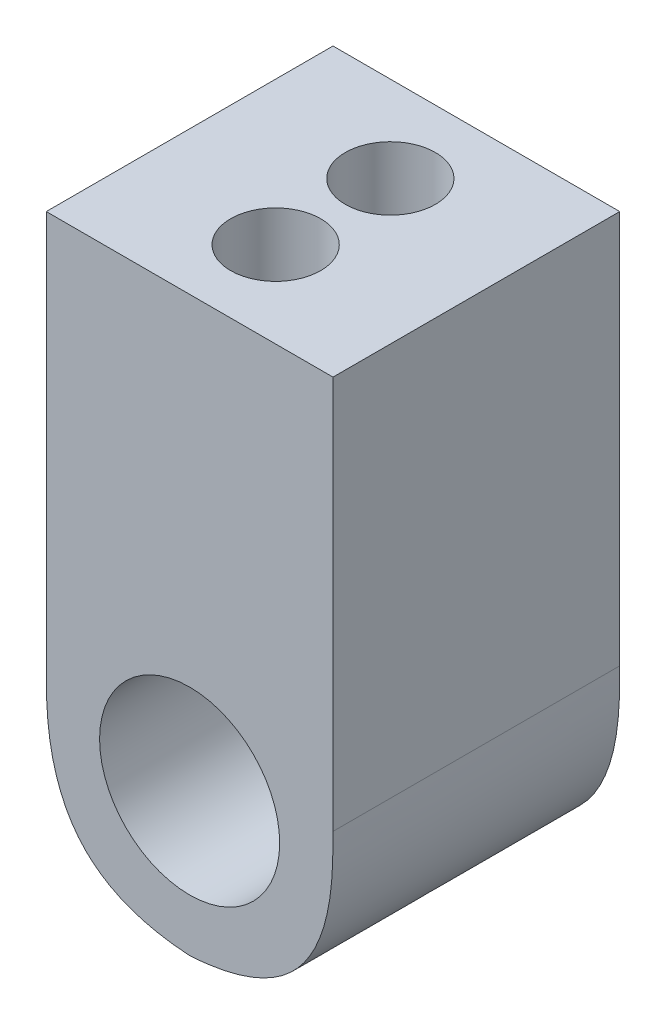
ISO-10303-21;
HEADER;
FILE_DESCRIPTION(('STEP AP214'),'2;1');
FILE_NAME('part.step','',(''),(''),'','','');
FILE_SCHEMA(('AUTOMOTIVE_DESIGN { 1 0 10303 214 1 1 1 1 }'));
ENDSEC;
DATA;
#1=APPLICATION_CONTEXT('core data for automotive mechanical design processes');
#2=APPLICATION_PROTOCOL_DEFINITION('international standard','automotive_design',2000,#1);
#3=PRODUCT_CONTEXT('',#1,'mechanical');
#4=PRODUCT('Part','Part','',(#3));
#5=PRODUCT_RELATED_PRODUCT_CATEGORY('part','',(#4));
#6=PRODUCT_DEFINITION_FORMATION('','',#4);
#7=PRODUCT_DEFINITION_CONTEXT('part definition',#1,'design');
#8=PRODUCT_DEFINITION('design','',#6,#7);
#9=PRODUCT_DEFINITION_SHAPE('','',#8);
#10=(LENGTH_UNIT() NAMED_UNIT(*) SI_UNIT(.MILLI.,.METRE.));
#11=(NAMED_UNIT(*) PLANE_ANGLE_UNIT() SI_UNIT($,.RADIAN.));
#12=(NAMED_UNIT(*) SI_UNIT($,.STERADIAN.) SOLID_ANGLE_UNIT());
#13=UNCERTAINTY_MEASURE_WITH_UNIT(LENGTH_MEASURE(1.E-05),#10,'distance_accuracy_value','');
#14=(GEOMETRIC_REPRESENTATION_CONTEXT(3) GLOBAL_UNCERTAINTY_ASSIGNED_CONTEXT((#13)) GLOBAL_UNIT_ASSIGNED_CONTEXT((#10,
#11,#12)) REPRESENTATION_CONTEXT('',''));
#15=CARTESIAN_POINT('',(0.,0.,0.));
#16=DIRECTION('',(0.,0.,1.));
#17=DIRECTION('',(1.,0.,0.));
#18=AXIS2_PLACEMENT_3D('',#15,#16,#17);
#19=CARTESIAN_POINT('',(-6.35,0.,-12.7));
#20=DIRECTION('',(1.,0.,0.));
#21=DIRECTION('',(0.,0.,-1.));
#22=AXIS2_PLACEMENT_3D('',#19,#20,#21);
#23=PLANE('',#22);
#24=DIRECTION('',(0.,1.,0.));
#25=VECTOR('',#24,1.);
#26=CARTESIAN_POINT('',(-6.35,0.,-12.7));
#27=LINE('',#26,#25);
#28=CARTESIAN_POINT('',(-6.35,1.6256,-12.7));
#29=VERTEX_POINT('',#28);
#30=CARTESIAN_POINT('',(-6.35,19.05,-12.7));
#31=VERTEX_POINT('',#30);
#32=EDGE_CURVE('E102',#29,#31,#27,.T.);
#33=ORIENTED_EDGE('',*,*,#32,.F.);
#34=CARTESIAN_POINT('',(-6.35,1.6256,0.635));
#35=CARTESIAN_POINT('',(-6.35,1.6256,-4.02166666666667));
#36=CARTESIAN_POINT('',(-6.35,1.6256,-8.67833333332475));
#37=CARTESIAN_POINT('',(-6.35,1.6256,-13.335));
#38=B_SPLINE_CURVE_WITH_KNOTS('',3,(#34,#35,#36,#37),.UNSPECIFIED.,.F.,.F.,(4,4),(-0.013335,
0.000635),.UNSPECIFIED.);
#39=CARTESIAN_POINT('',(-6.35,1.6256,0.));
#40=VERTEX_POINT('',#39);
#41=EDGE_CURVE('E116',#29,#40,#38,.F.);
#42=ORIENTED_EDGE('',*,*,#41,.T.);
#43=DIRECTION('',(0.,1.,0.));
#44=VECTOR('',#43,1.);
#45=CARTESIAN_POINT('',(-6.35,0.,0.));
#46=LINE('',#45,#44);
#47=CARTESIAN_POINT('',(-6.35,19.05,0.));
#48=VERTEX_POINT('',#47);
#49=EDGE_CURVE('E120',#40,#48,#46,.T.);
#50=ORIENTED_EDGE('',*,*,#49,.T.);
#51=DIRECTION('',(0.,0.,1.));
#52=VECTOR('',#51,1.);
#53=CARTESIAN_POINT('',(-6.35,19.05,-12.7));
#54=LINE('',#53,#52);
#55=EDGE_CURVE('E114',#31,#48,#54,.T.);
#56=ORIENTED_EDGE('',*,*,#55,.F.);
#57=EDGE_LOOP('',(#33,#42,#50,#56));
#58=FACE_BOUND('',#57,.T.);
#59=ADVANCED_FACE('F43',(#58),#23,.F.);
#60=CARTESIAN_POINT('',(0.,19.05,-12.7));
#61=DIRECTION('',(0.,-1.,0.));
#62=DIRECTION('',(0.,0.,-1.));
#63=AXIS2_PLACEMENT_3D('',#60,#61,#62);
#64=PLANE('',#63);
#65=CARTESIAN_POINT('',(0.,19.05,-8.89));
#66=DIRECTION('',(0.,1.,0.));
#67=DIRECTION('',(0.,0.,1.));
#68=AXIS2_PLACEMENT_3D('',#65,#66,#67);
#69=CIRCLE('',#68,1.9939);
#70=CARTESIAN_POINT('',(0.,19.05,-6.8961));
#71=VERTEX_POINT('',#70);
#72=EDGE_CURVE('E179',#71,#71,#69,.T.);
#73=ORIENTED_EDGE('',*,*,#72,.F.);
#74=EDGE_LOOP('',(#73));
#75=FACE_BOUND('',#74,.T.);
#76=CARTESIAN_POINT('',(0.,19.05,-3.81));
#77=DIRECTION('',(0.,1.,0.));
#78=DIRECTION('',(0.,0.,1.));
#79=AXIS2_PLACEMENT_3D('',#76,#77,#78);
#80=CIRCLE('',#79,1.9939);
#81=CARTESIAN_POINT('',(0.,19.05,-1.8161));
#82=VERTEX_POINT('',#81);
#83=EDGE_CURVE('E172',#82,#82,#80,.T.);
#84=ORIENTED_EDGE('',*,*,#83,.F.);
#85=EDGE_LOOP('',(#84));
#86=FACE_BOUND('',#85,.T.);
#87=DIRECTION('',(1.,0.,0.));
#88=VECTOR('',#87,1.);
#89=CARTESIAN_POINT('',(0.,19.05,0.));
#90=LINE('',#89,#88);
#91=CARTESIAN_POINT('',(6.35,19.05,0.));
#92=VERTEX_POINT('',#91);
#93=EDGE_CURVE('E113',#48,#92,#90,.T.);
#94=ORIENTED_EDGE('',*,*,#93,.T.);
#95=DIRECTION('',(0.,0.,1.));
#96=VECTOR('',#95,1.);
#97=CARTESIAN_POINT('',(6.35,19.05,-12.7));
#98=LINE('',#97,#96);
#99=CARTESIAN_POINT('',(6.35,19.05,-12.7));
#100=VERTEX_POINT('',#99);
#101=EDGE_CURVE('E99',#100,#92,#98,.T.);
#102=ORIENTED_EDGE('',*,*,#101,.F.);
#103=DIRECTION('',(1.,0.,0.));
#104=VECTOR('',#103,1.);
#105=CARTESIAN_POINT('',(0.,19.05,-12.7));
#106=LINE('',#105,#104);
#107=EDGE_CURVE('E101',#31,#100,#106,.T.);
#108=ORIENTED_EDGE('',*,*,#107,.F.);
#109=ORIENTED_EDGE('',*,*,#55,.T.);
#110=EDGE_LOOP('',(#94,#102,#108,#109));
#111=FACE_BOUND('',#110,.T.);
#112=ADVANCED_FACE('F111',(#75,#86,#111),#64,.F.);
#113=CARTESIAN_POINT('',(6.35,0.,-12.7));
#114=DIRECTION('',(1.,0.,0.));
#115=DIRECTION('',(0.,0.,-1.));
#116=AXIS2_PLACEMENT_3D('',#113,#114,#115);
#117=PLANE('',#116);
#118=DIRECTION('',(0.,1.,0.));
#119=VECTOR('',#118,1.);
#120=CARTESIAN_POINT('',(6.35,0.,0.));
#121=LINE('',#120,#119);
#122=CARTESIAN_POINT('',(6.35,1.6256,0.));
#123=VERTEX_POINT('',#122);
#124=EDGE_CURVE('E123',#123,#92,#121,.T.);
#125=ORIENTED_EDGE('',*,*,#124,.F.);
#126=CARTESIAN_POINT('',(6.35,1.6256,-13.335));
#127=CARTESIAN_POINT('',(6.35,1.6256,-8.67833333332475));
#128=CARTESIAN_POINT('',(6.35,1.6256,-4.02166666666667));
#129=CARTESIAN_POINT('',(6.35,1.6256,0.634999999999998));
#130=B_SPLINE_CURVE_WITH_KNOTS('',3,(#126,#127,#128,#129),.UNSPECIFIED.,.F.,.F.,(4,4),
(-0.000635,0.013335),.UNSPECIFIED.);
#131=CARTESIAN_POINT('',(6.35,1.6256,-12.7));
#132=VERTEX_POINT('',#131);
#133=EDGE_CURVE('E11',#123,#132,#130,.F.);
#134=ORIENTED_EDGE('',*,*,#133,.T.);
#135=DIRECTION('',(0.,1.,0.));
#136=VECTOR('',#135,1.);
#137=CARTESIAN_POINT('',(6.35,0.,-12.7));
#138=LINE('',#137,#136);
#139=EDGE_CURVE('E95',#132,#100,#138,.T.);
#140=ORIENTED_EDGE('',*,*,#139,.T.);
#141=ORIENTED_EDGE('',*,*,#101,.T.);
#142=EDGE_LOOP('',(#125,#134,#140,#141));
#143=FACE_BOUND('',#142,.T.);
#144=ADVANCED_FACE('F97',(#143),#117,.T.);
#145=CARTESIAN_POINT('',(0.,0.,-12.7));
#146=DIRECTION('',(0.,0.,1.));
#147=DIRECTION('',(1.,0.,0.));
#148=AXIS2_PLACEMENT_3D('',#145,#146,#147);
#149=PLANE('',#148);
#150=CARTESIAN_POINT('',(0.,0.,-12.7));
#151=DIRECTION('',(0.,0.,1.));
#152=DIRECTION('',(1.,0.,0.));
#153=AXIS2_PLACEMENT_3D('',#150,#151,#152);
#154=CIRCLE('',#153,3.9878);
#155=CARTESIAN_POINT('',(3.9878,0.,-12.7));
#156=VERTEX_POINT('',#155);
#157=EDGE_CURVE('E176',#156,#156,#154,.T.);
#158=ORIENTED_EDGE('',*,*,#157,.T.);
#159=EDGE_LOOP('',(#158));
#160=FACE_BOUND('',#159,.T.);
#161=CARTESIAN_POINT('',(-1.6256,-6.35,-12.7));
#162=CARTESIAN_POINT('',(-0.284119620185859,-6.35,-12.7));
#163=CARTESIAN_POINT('',(1.05736075962828,-6.35,-12.7));
#164=CARTESIAN_POINT('',(4.01400084403143,-5.77821392415533,-12.7));
#165=CARTESIAN_POINT('',(5.77821392415533,-4.01400084403143,-12.7));
#166=CARTESIAN_POINT('',(6.35,-1.05736075962829,-12.7));
#167=CARTESIAN_POINT('',(6.35,0.284119620185857,-12.7));
#168=CARTESIAN_POINT('',(6.35,1.6256,-12.7));
#169=B_SPLINE_CURVE_WITH_KNOTS('',5,(#161,#162,#163,#164,#165,#166,#167,#168),.UNSPECIFIED.,.F.,
.F.,(6,2,6),(0.,0.5,1.),.UNSPECIFIED.);
#170=CARTESIAN_POINT('',(-7.25062341599403E-07,-6.3144499642676,-12.7));
#171=VERTEX_POINT('',#170);
#172=EDGE_CURVE('E64',#132,#171,#169,.F.);
#173=ORIENTED_EDGE('',*,*,#172,.T.);
#174=CARTESIAN_POINT('',(-6.35,1.6256,-12.7));
#175=CARTESIAN_POINT('',(-6.35,0.284119620185856,-12.7));
#176=CARTESIAN_POINT('',(-6.35,-1.05736075962829,-12.7));
#177=CARTESIAN_POINT('',(-5.77821392415534,-4.01400084403143,-12.7));
#178=CARTESIAN_POINT('',(-4.01400084403143,-5.77821392415533,-12.7));
#179=CARTESIAN_POINT('',(-1.05736075962829,-6.35,-12.7));
#180=CARTESIAN_POINT('',(0.284119620185855,-6.35,-12.7));
#181=CARTESIAN_POINT('',(1.6256,-6.35,-12.7));
#182=B_SPLINE_CURVE_WITH_KNOTS('',5,(#174,#175,#176,#177,#178,#179,#180,#181),.UNSPECIFIED.,.F.,
.F.,(6,2,6),(0.,0.5,1.),.UNSPECIFIED.);
#183=EDGE_CURVE('E57',#171,#29,#182,.F.);
#184=ORIENTED_EDGE('',*,*,#183,.T.);
#185=ORIENTED_EDGE('',*,*,#32,.T.);
#186=ORIENTED_EDGE('',*,*,#107,.T.);
#187=ORIENTED_EDGE('',*,*,#139,.F.);
#188=EDGE_LOOP('',(#173,#184,#185,#186,#187));
#189=FACE_BOUND('',#188,.T.);
#190=ADVANCED_FACE('F105',(#160,#189),#149,.F.);
#191=CARTESIAN_POINT('',(0.,0.,0.));
#192=DIRECTION('',(0.,0.,1.));
#193=DIRECTION('',(1.,0.,0.));
#194=AXIS2_PLACEMENT_3D('',#191,#192,#193);
#195=PLANE('',#194);
#196=CARTESIAN_POINT('',(0.,0.,0.));
#197=DIRECTION('',(0.,0.,1.));
#198=DIRECTION('',(1.,0.,0.));
#199=AXIS2_PLACEMENT_3D('',#196,#197,#198);
#200=CIRCLE('',#199,3.9878);
#201=CARTESIAN_POINT('',(3.9878,0.,0.));
#202=VERTEX_POINT('',#201);
#203=EDGE_CURVE('E187',#202,#202,#200,.T.);
#204=ORIENTED_EDGE('',*,*,#203,.F.);
#205=EDGE_LOOP('',(#204));
#206=FACE_BOUND('',#205,.T.);
#207=ORIENTED_EDGE('',*,*,#49,.F.);
#208=CARTESIAN_POINT('',(1.6256,-6.35,0.));
#209=CARTESIAN_POINT('',(0.284119620185855,-6.35,0.));
#210=CARTESIAN_POINT('',(-1.05736075962829,-6.35,0.));
#211=CARTESIAN_POINT('',(-4.01400084403143,-5.77821392415533,0.));
#212=CARTESIAN_POINT('',(-5.77821392415534,-4.01400084403143,0.));
#213=CARTESIAN_POINT('',(-6.35,-1.05736075962829,0.));
#214=CARTESIAN_POINT('',(-6.35,0.284119620185856,0.));
#215=CARTESIAN_POINT('',(-6.35,1.6256,0.));
#216=B_SPLINE_CURVE_WITH_KNOTS('',5,(#208,#209,#210,#211,#212,#213,#214,#215),.UNSPECIFIED.,.F.,
.F.,(6,2,6),(0.,0.5,1.),.UNSPECIFIED.);
#217=CARTESIAN_POINT('',(-4.50984004952076E-07,-6.31445417406303,0.));
#218=VERTEX_POINT('',#217);
#219=EDGE_CURVE('E194',#40,#218,#216,.F.);
#220=ORIENTED_EDGE('',*,*,#219,.T.);
#221=CARTESIAN_POINT('',(6.35,1.6256,0.));
#222=CARTESIAN_POINT('',(6.35,0.284119620185857,0.));
#223=CARTESIAN_POINT('',(6.35,-1.05736075962829,0.));
#224=CARTESIAN_POINT('',(5.77821392415533,-4.01400084403143,0.));
#225=CARTESIAN_POINT('',(4.01400084403143,-5.77821392415533,0.));
#226=CARTESIAN_POINT('',(1.05736075962828,-6.35,0.));
#227=CARTESIAN_POINT('',(-0.284119620185859,-6.35,0.));
#228=CARTESIAN_POINT('',(-1.6256,-6.35,0.));
#229=B_SPLINE_CURVE_WITH_KNOTS('',5,(#221,#222,#223,#224,#225,#226,#227,#228),.UNSPECIFIED.,.F.,
.F.,(6,2,6),(0.,0.5,1.),.UNSPECIFIED.);
#230=EDGE_CURVE('E140',#218,#123,#229,.F.);
#231=ORIENTED_EDGE('',*,*,#230,.T.);
#232=ORIENTED_EDGE('',*,*,#124,.T.);
#233=ORIENTED_EDGE('',*,*,#93,.F.);
#234=EDGE_LOOP('',(#207,#220,#231,#232,#233));
#235=FACE_BOUND('',#234,.T.);
#236=ADVANCED_FACE('F146',(#206,#235),#195,.T.);
#237=CARTESIAN_POINT('',(-1.6256,-6.35,-13.335));
#238=CARTESIAN_POINT('',(-1.6256,-6.35,-8.67833333332475));
#239=CARTESIAN_POINT('',(-1.6256,-6.35,-4.02166666666667));
#240=CARTESIAN_POINT('',(-1.6256,-6.35,0.634999999999998));
#241=CARTESIAN_POINT('',(-0.284119620185859,-6.35,-13.335));
#242=CARTESIAN_POINT('',(-0.284119620185859,-6.35,-8.67833333332475));
#243=CARTESIAN_POINT('',(-0.284119620185859,-6.35,-4.02166666666667));
#244=CARTESIAN_POINT('',(-0.284119620185859,-6.35,0.634999999999998));
#245=CARTESIAN_POINT('',(1.05736075962828,-6.35,-13.335));
#246=CARTESIAN_POINT('',(1.05736075962828,-6.35,-8.67833333332475));
#247=CARTESIAN_POINT('',(1.05736075962828,-6.35,-4.02166666666667));
#248=CARTESIAN_POINT('',(1.05736075962828,-6.35,0.634999999999998));
#249=CARTESIAN_POINT('',(4.01400084403143,-5.77821392415533,-13.335));
#250=CARTESIAN_POINT('',(4.01400084403143,-5.77821392415533,-8.67833333332475));
#251=CARTESIAN_POINT('',(4.01400084403143,-5.77821392415533,-4.02166666666667));
#252=CARTESIAN_POINT('',(4.01400084403143,-5.77821392415533,0.634999999999998));
#253=CARTESIAN_POINT('',(5.77821392415533,-4.01400084403143,-13.335));
#254=CARTESIAN_POINT('',(5.77821392415533,-4.01400084403143,-8.67833333332475));
#255=CARTESIAN_POINT('',(5.77821392415533,-4.01400084403143,-4.02166666666667));
#256=CARTESIAN_POINT('',(5.77821392415533,-4.01400084403143,0.634999999999998));
#257=CARTESIAN_POINT('',(6.35,-1.05736075962829,-13.335));
#258=CARTESIAN_POINT('',(6.35,-1.05736075962829,-8.67833333332475));
#259=CARTESIAN_POINT('',(6.35,-1.05736075962829,-4.02166666666667));
#260=CARTESIAN_POINT('',(6.35,-1.05736075962829,0.634999999999998));
#261=CARTESIAN_POINT('',(6.35,0.284119620185857,-13.335));
#262=CARTESIAN_POINT('',(6.35,0.284119620185857,-8.67833333332475));
#263=CARTESIAN_POINT('',(6.35,0.284119620185857,-4.02166666666667));
#264=CARTESIAN_POINT('',(6.35,0.284119620185857,0.634999999999998));
#265=CARTESIAN_POINT('',(6.35,1.6256,-13.335));
#266=CARTESIAN_POINT('',(6.35,1.6256,-8.67833333332475));
#267=CARTESIAN_POINT('',(6.35,1.6256,-4.02166666666667));
#268=CARTESIAN_POINT('',(6.35,1.6256,0.634999999999998));
#269=B_SPLINE_SURFACE_WITH_KNOTS('',5,3,((#237,#238,#239,#240),(#241,#242,#243,#244),(#245,#246,
#247,#248),(#249,#250,#251,#252),(#253,#254,#255,#256),(#257,#258,#259,#260),(#261,#262,#263,
#264),(#265,#266,#267,#268)),.UNSPECIFIED.,.F.,.F.,.F.,(6,2,6),(4,4),(0.,0.5,1.),(-0.000635,
0.013335),.UNSPECIFIED.);
#270=CARTESIAN_POINT('',(0.,-6.31446149156776,-13.335));
#271=CARTESIAN_POINT('',(0.,-6.31446149156776,-8.67833333332475));
#272=CARTESIAN_POINT('',(0.,-6.31446149156776,-4.02166666666667));
#273=CARTESIAN_POINT('',(0.,-6.31446149156776,0.635));
#274=B_SPLINE_CURVE_WITH_KNOTS('',3,(#270,#271,#272,#273),.UNSPECIFIED.,.F.,.F.,(4,4),
(-0.013335,0.000635),.UNSPECIFIED.);
#275=EDGE_CURVE('E124',#171,#218,#274,.T.);
#276=ORIENTED_EDGE('',*,*,#275,.F.);
#277=ORIENTED_EDGE('',*,*,#172,.F.);
#278=ORIENTED_EDGE('',*,*,#133,.F.);
#279=ORIENTED_EDGE('',*,*,#230,.F.);
#280=EDGE_LOOP('',(#276,#277,#278,#279));
#281=FACE_BOUND('',#280,.T.);
#282=ADVANCED_FACE('F46',(#281),#269,.T.);
#283=CARTESIAN_POINT('',(1.6256,-6.35,0.635));
#284=CARTESIAN_POINT('',(1.6256,-6.35,-4.02166666666667));
#285=CARTESIAN_POINT('',(1.6256,-6.35,-8.67833333332475));
#286=CARTESIAN_POINT('',(1.6256,-6.35,-13.335));
#287=CARTESIAN_POINT('',(0.284119620185855,-6.35,0.635));
#288=CARTESIAN_POINT('',(0.284119620185855,-6.35,-4.02166666666667));
#289=CARTESIAN_POINT('',(0.284119620185855,-6.35,-8.67833333332475));
#290=CARTESIAN_POINT('',(0.284119620185855,-6.35,-13.335));
#291=CARTESIAN_POINT('',(-1.05736075962829,-6.35,0.635));
#292=CARTESIAN_POINT('',(-1.05736075962829,-6.35,-4.02166666666667));
#293=CARTESIAN_POINT('',(-1.05736075962829,-6.35,-8.67833333332475));
#294=CARTESIAN_POINT('',(-1.05736075962829,-6.35,-13.335));
#295=CARTESIAN_POINT('',(-4.01400084403143,-5.77821392415533,0.635));
#296=CARTESIAN_POINT('',(-4.01400084403143,-5.77821392415533,-4.02166666666667));
#297=CARTESIAN_POINT('',(-4.01400084403143,-5.77821392415533,-8.67833333332475));
#298=CARTESIAN_POINT('',(-4.01400084403143,-5.77821392415533,-13.335));
#299=CARTESIAN_POINT('',(-5.77821392415534,-4.01400084403143,0.635));
#300=CARTESIAN_POINT('',(-5.77821392415534,-4.01400084403143,-4.02166666666667));
#301=CARTESIAN_POINT('',(-5.77821392415534,-4.01400084403143,-8.67833333332475));
#302=CARTESIAN_POINT('',(-5.77821392415534,-4.01400084403143,-13.335));
#303=CARTESIAN_POINT('',(-6.35,-1.05736075962829,0.635));
#304=CARTESIAN_POINT('',(-6.35,-1.05736075962829,-4.02166666666667));
#305=CARTESIAN_POINT('',(-6.35,-1.05736075962829,-8.67833333332475));
#306=CARTESIAN_POINT('',(-6.35,-1.05736075962829,-13.335));
#307=CARTESIAN_POINT('',(-6.35,0.284119620185856,0.635));
#308=CARTESIAN_POINT('',(-6.35,0.284119620185856,-4.02166666666667));
#309=CARTESIAN_POINT('',(-6.35,0.284119620185856,-8.67833333332475));
#310=CARTESIAN_POINT('',(-6.35,0.284119620185856,-13.335));
#311=CARTESIAN_POINT('',(-6.35,1.6256,0.635));
#312=CARTESIAN_POINT('',(-6.35,1.6256,-4.02166666666667));
#313=CARTESIAN_POINT('',(-6.35,1.6256,-8.67833333332475));
#314=CARTESIAN_POINT('',(-6.35,1.6256,-13.335));
#315=B_SPLINE_SURFACE_WITH_KNOTS('',5,3,((#283,#284,#285,#286),(#287,#288,#289,#290),(#291,#292,
#293,#294),(#295,#296,#297,#298),(#299,#300,#301,#302),(#303,#304,#305,#306),(#307,#308,#309,
#310),(#311,#312,#313,#314)),.UNSPECIFIED.,.F.,.F.,.F.,(6,2,6),(4,4),(0.,0.5,1.),(-0.013335,
0.000635),.UNSPECIFIED.);
#316=ORIENTED_EDGE('',*,*,#183,.F.);
#317=ORIENTED_EDGE('',*,*,#275,.T.);
#318=ORIENTED_EDGE('',*,*,#219,.F.);
#319=ORIENTED_EDGE('',*,*,#41,.F.);
#320=EDGE_LOOP('',(#316,#317,#318,#319));
#321=FACE_BOUND('',#320,.T.);
#322=ADVANCED_FACE('F229',(#321),#315,.T.);
#323=CARTESIAN_POINT('',(0.,12.7,-3.81));
#324=DIRECTION('',(0.,1.,0.));
#325=DIRECTION('',(0.,0.,1.));
#326=AXIS2_PLACEMENT_3D('',#323,#324,#325);
#327=CYLINDRICAL_SURFACE('',#326,1.9939);
#328=CARTESIAN_POINT('',(0.,12.7,-3.81));
#329=DIRECTION('',(0.,1.,0.));
#330=DIRECTION('',(0.,0.,1.));
#331=AXIS2_PLACEMENT_3D('',#328,#329,#330);
#332=CIRCLE('',#331,1.9939);
#333=CARTESIAN_POINT('',(0.,12.7,-1.8161));
#334=VERTEX_POINT('',#333);
#335=EDGE_CURVE('E175',#334,#334,#332,.T.);
#336=ORIENTED_EDGE('',*,*,#335,.F.);
#337=EDGE_LOOP('',(#336));
#338=FACE_BOUND('',#337,.T.);
#339=ORIENTED_EDGE('',*,*,#83,.T.);
#340=EDGE_LOOP('',(#339));
#341=FACE_BOUND('',#340,.T.);
#342=ADVANCED_FACE('F236',(#338,#341),#327,.F.);
#343=CARTESIAN_POINT('',(0.,12.7,0.));
#344=DIRECTION('',(0.,1.,0.));
#345=DIRECTION('',(0.,0.,1.));
#346=AXIS2_PLACEMENT_3D('',#343,#344,#345);
#347=PLANE('',#346);
#348=ORIENTED_EDGE('',*,*,#335,.T.);
#349=EDGE_LOOP('',(#348));
#350=FACE_BOUND('',#349,.T.);
#351=ADVANCED_FACE('F313',(#350),#347,.T.);
#352=CARTESIAN_POINT('',(0.,12.7,-8.89));
#353=DIRECTION('',(0.,1.,0.));
#354=DIRECTION('',(0.,0.,1.));
#355=AXIS2_PLACEMENT_3D('',#352,#353,#354);
#356=CYLINDRICAL_SURFACE('',#355,1.9939);
#357=CARTESIAN_POINT('',(0.,12.7,-8.89));
#358=DIRECTION('',(0.,1.,0.));
#359=DIRECTION('',(0.,0.,1.));
#360=AXIS2_PLACEMENT_3D('',#357,#358,#359);
#361=CIRCLE('',#360,1.9939);
#362=CARTESIAN_POINT('',(0.,12.7,-6.8961));
#363=VERTEX_POINT('',#362);
#364=EDGE_CURVE('E182',#363,#363,#361,.T.);
#365=ORIENTED_EDGE('',*,*,#364,.F.);
#366=EDGE_LOOP('',(#365));
#367=FACE_BOUND('',#366,.T.);
#368=ORIENTED_EDGE('',*,*,#72,.T.);
#369=EDGE_LOOP('',(#368));
#370=FACE_BOUND('',#369,.T.);
#371=ADVANCED_FACE('F320',(#367,#370),#356,.F.);
#372=CARTESIAN_POINT('',(0.,12.7,0.));
#373=DIRECTION('',(0.,1.,0.));
#374=DIRECTION('',(0.,0.,1.));
#375=AXIS2_PLACEMENT_3D('',#372,#373,#374);
#376=PLANE('',#375);
#377=ORIENTED_EDGE('',*,*,#364,.T.);
#378=EDGE_LOOP('',(#377));
#379=FACE_BOUND('',#378,.T.);
#380=ADVANCED_FACE('F328',(#379),#376,.T.);
#381=CARTESIAN_POINT('',(0.,0.,-12.750000000001));
#382=DIRECTION('',(0.,0.,1.));
#383=DIRECTION('',(1.,0.,0.));
#384=AXIS2_PLACEMENT_3D('',#381,#382,#383);
#385=CYLINDRICAL_SURFACE('',#384,3.9878);
#386=ORIENTED_EDGE('',*,*,#203,.T.);
#387=EDGE_LOOP('',(#386));
#388=FACE_BOUND('',#387,.T.);
#389=ORIENTED_EDGE('',*,*,#157,.F.);
#390=EDGE_LOOP('',(#389));
#391=FACE_BOUND('',#390,.T.);
#392=ADVANCED_FACE('F191',(#388,#391),#385,.F.);
#393=CLOSED_SHELL('',(#59,#112,#144,#190,#236,#282,#322,#342,#351,#371,#380,#392));
#394=MANIFOLD_SOLID_BREP('B2',#393);
#395=ADVANCED_BREP_SHAPE_REPRESENTATION('',(#18,#394),#14);
#396=SHAPE_DEFINITION_REPRESENTATION(#9,#395);
ENDSEC;
END-ISO-10303-21;
